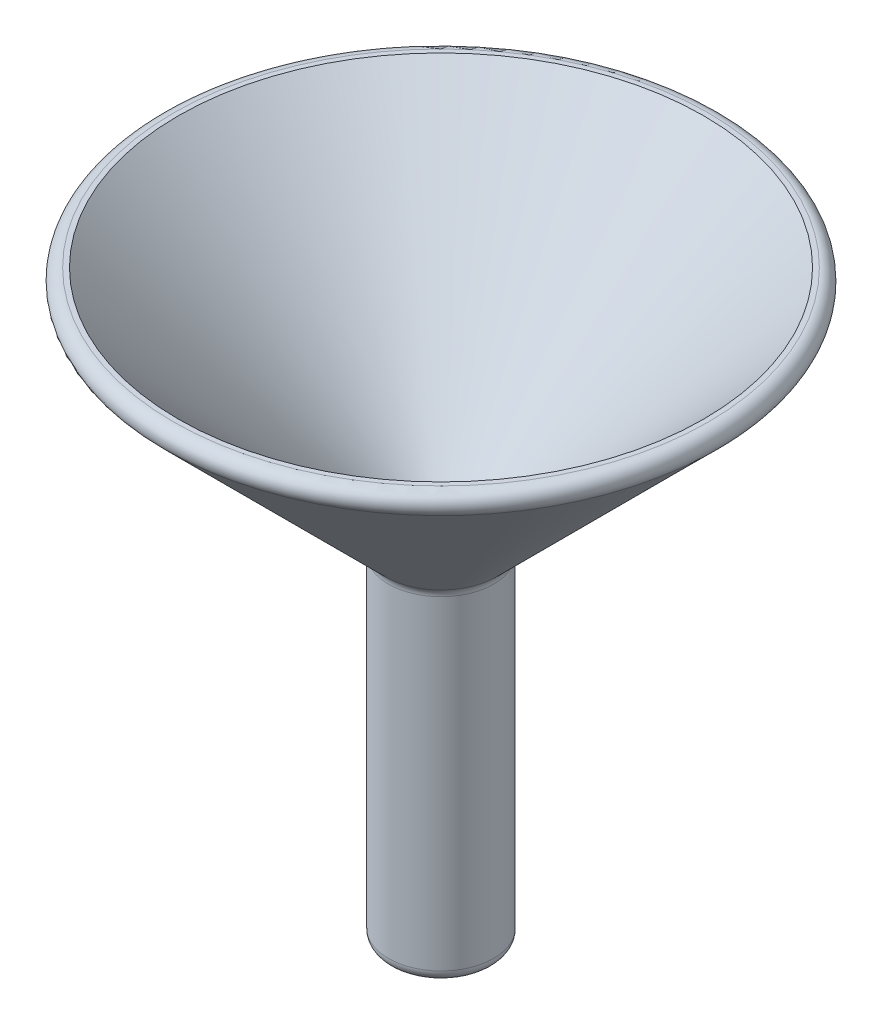
ISO-10303-21;
HEADER;
FILE_DESCRIPTION(('STEP AP214'),'2;1');
FILE_NAME('part.step','',(''),(''),'','','');
FILE_SCHEMA(('AUTOMOTIVE_DESIGN { 1 0 10303 214 1 1 1 1 }'));
ENDSEC;
DATA;
#1=APPLICATION_CONTEXT('core data for automotive mechanical design processes');
#2=APPLICATION_PROTOCOL_DEFINITION('international standard','automotive_design',2000,#1);
#3=PRODUCT_CONTEXT('',#1,'mechanical');
#4=PRODUCT('Part','Part','',(#3));
#5=PRODUCT_RELATED_PRODUCT_CATEGORY('part','',(#4));
#6=PRODUCT_DEFINITION_FORMATION('','',#4);
#7=PRODUCT_DEFINITION_CONTEXT('part definition',#1,'design');
#8=PRODUCT_DEFINITION('design','',#6,#7);
#9=PRODUCT_DEFINITION_SHAPE('','',#8);
#10=(LENGTH_UNIT() NAMED_UNIT(*) SI_UNIT(.MILLI.,.METRE.));
#11=(NAMED_UNIT(*) PLANE_ANGLE_UNIT() SI_UNIT($,.RADIAN.));
#12=(NAMED_UNIT(*) SI_UNIT($,.STERADIAN.) SOLID_ANGLE_UNIT());
#13=UNCERTAINTY_MEASURE_WITH_UNIT(LENGTH_MEASURE(1.E-05),#10,'distance_accuracy_value','');
#14=(GEOMETRIC_REPRESENTATION_CONTEXT(3) GLOBAL_UNCERTAINTY_ASSIGNED_CONTEXT((#13)) GLOBAL_UNIT_ASSIGNED_CONTEXT((#10,
#11,#12)) REPRESENTATION_CONTEXT('',''));
#15=CARTESIAN_POINT('',(0.,0.,0.));
#16=DIRECTION('',(0.,0.,1.));
#17=DIRECTION('',(1.,0.,0.));
#18=AXIS2_PLACEMENT_3D('',#15,#16,#17);
#19=CARTESIAN_POINT('',(0.,20.0000000000002,0.));
#20=DIRECTION('',(0.,1.,0.));
#21=DIRECTION('',(0.,0.,1.));
#22=AXIS2_PLACEMENT_3D('',#19,#20,#21);
#23=CONICAL_SURFACE('',#22,22.5,0.785398163397443);
#24=CARTESIAN_POINT('',(0.,0.,0.));
#25=DIRECTION('',(0.,-1.,0.));
#26=DIRECTION('',(0.,0.,-1.));
#27=AXIS2_PLACEMENT_3D('',#24,#25,#26);
#28=CIRCLE('',#27,2.5);
#29=CARTESIAN_POINT('',(0.,0.,-2.5));
#30=VERTEX_POINT('',#29);
#31=EDGE_CURVE('E63',#30,#30,#28,.T.);
#32=ORIENTED_EDGE('',*,*,#31,.T.);
#33=EDGE_LOOP('',(#32));
#34=FACE_BOUND('',#33,.T.);
#35=CARTESIAN_POINT('',(0.,20.0000000000002,0.));
#36=DIRECTION('',(0.,-1.,0.));
#37=DIRECTION('',(0.,0.,-1.));
#38=AXIS2_PLACEMENT_3D('',#35,#36,#37);
#39=CIRCLE('',#38,22.5);
#40=CARTESIAN_POINT('',(0.,20.0000000000002,-22.5));
#41=VERTEX_POINT('',#40);
#42=EDGE_CURVE('E57',#41,#41,#39,.T.);
#43=ORIENTED_EDGE('',*,*,#42,.F.);
#44=EDGE_LOOP('',(#43));
#45=FACE_BOUND('',#44,.T.);
#46=ADVANCED_FACE('F31',(#34,#45),#23,.F.);
#47=CARTESIAN_POINT('',(22.5,20.0000000000002,0.));
#48=DIRECTION('',(0.,1.,0.));
#49=DIRECTION('',(0.,0.,1.));
#50=AXIS2_PLACEMENT_3D('',#47,#48,#49);
#51=PLANE('',#50);
#52=CARTESIAN_POINT('',(0.,20.0000000000002,0.));
#53=DIRECTION('',(0.,1.,0.));
#54=DIRECTION('',(0.,0.,1.));
#55=AXIS2_PLACEMENT_3D('',#52,#53,#54);
#56=CIRCLE('',#55,22.9142135623731);
#57=CARTESIAN_POINT('',(0.,20.0000000000002,22.9142135623731));
#58=VERTEX_POINT('',#57);
#59=EDGE_CURVE('E46',#58,#58,#56,.T.);
#60=ORIENTED_EDGE('',*,*,#59,.T.);
#61=EDGE_LOOP('',(#60));
#62=FACE_BOUND('',#61,.T.);
#63=ORIENTED_EDGE('',*,*,#42,.T.);
#64=EDGE_LOOP('',(#63));
#65=FACE_BOUND('',#64,.T.);
#66=ADVANCED_FACE('F85',(#62,#65),#51,.T.);
#67=CARTESIAN_POINT('',(0.,-0.828427124746184,0.));
#68=DIRECTION('',(0.,1.,0.));
#69=DIRECTION('',(0.,0.,1.));
#70=AXIS2_PLACEMENT_3D('',#67,#68,#69);
#71=CONICAL_SURFACE('',#70,4.5,0.785398163397443);
#72=CARTESIAN_POINT('',(0.,18.2928932188137,0.));
#73=DIRECTION('',(0.,-1.,0.));
#74=DIRECTION('',(0.,0.,-1.));
#75=AXIS2_PLACEMENT_3D('',#72,#73,#74);
#76=CIRCLE('',#75,23.6213203435596);
#77=CARTESIAN_POINT('',(0.,18.2928932188137,-23.6213203435596));
#78=VERTEX_POINT('',#77);
#79=EDGE_CURVE('E51',#78,#78,#76,.T.);
#80=ORIENTED_EDGE('',*,*,#79,.T.);
#81=EDGE_LOOP('',(#80));
#82=FACE_BOUND('',#81,.T.);
#83=CARTESIAN_POINT('',(0.,-0.53553390593273,0.));
#84=DIRECTION('',(0.,1.,0.));
#85=DIRECTION('',(0.,0.,1.));
#86=AXIS2_PLACEMENT_3D('',#83,#84,#85);
#87=CIRCLE('',#86,4.79289321881345);
#88=CARTESIAN_POINT('',(0.,-0.53553390593273,4.79289321881345));
#89=VERTEX_POINT('',#88);
#90=EDGE_CURVE('E54',#89,#89,#87,.T.);
#91=ORIENTED_EDGE('',*,*,#90,.T.);
#92=EDGE_LOOP('',(#91));
#93=FACE_BOUND('',#92,.T.);
#94=ADVANCED_FACE('F90',(#82,#93),#71,.T.);
#95=CARTESIAN_POINT('',(0.,0.,0.));
#96=DIRECTION('',(0.,-1.,0.));
#97=DIRECTION('',(0.,0.,-1.));
#98=AXIS2_PLACEMENT_3D('',#95,#96,#97);
#99=CYLINDRICAL_SURFACE('',#98,4.5);
#100=CARTESIAN_POINT('',(0.,-1.24264068711927,0.));
#101=DIRECTION('',(0.,-1.,0.));
#102=DIRECTION('',(0.,0.,-1.));
#103=AXIS2_PLACEMENT_3D('',#100,#101,#102);
#104=CIRCLE('',#103,4.5);
#105=CARTESIAN_POINT('',(0.,-1.24264068711927,-4.5));
#106=VERTEX_POINT('',#105);
#107=EDGE_CURVE('E38',#106,#106,#104,.T.);
#108=ORIENTED_EDGE('',*,*,#107,.T.);
#109=EDGE_LOOP('',(#108));
#110=FACE_BOUND('',#109,.T.);
#111=CARTESIAN_POINT('',(0.,-29.,0.));
#112=DIRECTION('',(0.,-1.,0.));
#113=DIRECTION('',(0.,0.,-1.));
#114=AXIS2_PLACEMENT_3D('',#111,#112,#113);
#115=CIRCLE('',#114,4.5);
#116=CARTESIAN_POINT('',(0.,-29.,-4.5));
#117=VERTEX_POINT('',#116);
#118=EDGE_CURVE('E42',#117,#117,#115,.F.);
#119=ORIENTED_EDGE('',*,*,#118,.T.);
#120=EDGE_LOOP('',(#119));
#121=FACE_BOUND('',#120,.T.);
#122=ADVANCED_FACE('F82',(#110,#121),#99,.T.);
#123=CARTESIAN_POINT('',(2.5,-30.,0.));
#124=DIRECTION('',(0.,-1.,0.));
#125=DIRECTION('',(0.,0.,-1.));
#126=AXIS2_PLACEMENT_3D('',#123,#124,#125);
#127=PLANE('',#126);
#128=CARTESIAN_POINT('',(0.,-30.,0.));
#129=DIRECTION('',(0.,-1.,0.));
#130=DIRECTION('',(0.,0.,-1.));
#131=AXIS2_PLACEMENT_3D('',#128,#129,#130);
#132=CIRCLE('',#131,3.5);
#133=CARTESIAN_POINT('',(0.,-30.,-3.5));
#134=VERTEX_POINT('',#133);
#135=EDGE_CURVE('E10',#134,#134,#132,.T.);
#136=ORIENTED_EDGE('',*,*,#135,.T.);
#137=EDGE_LOOP('',(#136));
#138=FACE_BOUND('',#137,.T.);
#139=CARTESIAN_POINT('',(0.,-30.,0.));
#140=DIRECTION('',(0.,-1.,0.));
#141=DIRECTION('',(0.,0.,-1.));
#142=AXIS2_PLACEMENT_3D('',#139,#140,#141);
#143=CIRCLE('',#142,2.5);
#144=CARTESIAN_POINT('',(0.,-30.,-2.5));
#145=VERTEX_POINT('',#144);
#146=EDGE_CURVE('E60',#145,#145,#143,.T.);
#147=ORIENTED_EDGE('',*,*,#146,.F.);
#148=EDGE_LOOP('',(#147));
#149=FACE_BOUND('',#148,.T.);
#150=ADVANCED_FACE('F72',(#138,#149),#127,.T.);
#151=CARTESIAN_POINT('',(0.,0.,0.));
#152=DIRECTION('',(0.,-1.,0.));
#153=DIRECTION('',(0.,0.,-1.));
#154=AXIS2_PLACEMENT_3D('',#151,#152,#153);
#155=CYLINDRICAL_SURFACE('',#154,2.5);
#156=ORIENTED_EDGE('',*,*,#146,.T.);
#157=EDGE_LOOP('',(#156));
#158=FACE_BOUND('',#157,.T.);
#159=ORIENTED_EDGE('',*,*,#31,.F.);
#160=EDGE_LOOP('',(#159));
#161=FACE_BOUND('',#160,.T.);
#162=ADVANCED_FACE('F69',(#158,#161),#155,.F.);
#163=CARTESIAN_POINT('',(0.,19.0000000000002,0.));
#164=DIRECTION('',(0.,1.,0.));
#165=DIRECTION('',(0.,0.,1.));
#166=AXIS2_PLACEMENT_3D('',#163,#164,#165);
#167=TOROIDAL_SURFACE('',#166,22.9142135623731,1.);
#168=ORIENTED_EDGE('',*,*,#59,.F.);
#169=EDGE_LOOP('',(#168));
#170=FACE_BOUND('',#169,.T.);
#171=ORIENTED_EDGE('',*,*,#79,.F.);
#172=EDGE_LOOP('',(#171));
#173=FACE_BOUND('',#172,.T.);
#174=ADVANCED_FACE('F71',(#170,#173),#167,.T.);
#175=CARTESIAN_POINT('',(0.,-1.24264068711927,0.));
#176=DIRECTION('',(0.,-1.,0.));
#177=DIRECTION('',(0.,0.,-1.));
#178=AXIS2_PLACEMENT_3D('',#175,#176,#177);
#179=TOROIDAL_SURFACE('',#178,5.5,1.);
#180=ORIENTED_EDGE('',*,*,#90,.F.);
#181=EDGE_LOOP('',(#180));
#182=FACE_BOUND('',#181,.T.);
#183=ORIENTED_EDGE('',*,*,#107,.F.);
#184=EDGE_LOOP('',(#183));
#185=FACE_BOUND('',#184,.T.);
#186=ADVANCED_FACE('F79',(#182,#185),#179,.F.);
#187=CARTESIAN_POINT('',(0.,-29.,0.));
#188=DIRECTION('',(0.,-1.,0.));
#189=DIRECTION('',(0.,0.,-1.));
#190=AXIS2_PLACEMENT_3D('',#187,#188,#189);
#191=TOROIDAL_SURFACE('',#190,3.5,1.);
#192=ORIENTED_EDGE('',*,*,#118,.F.);
#193=EDGE_LOOP('',(#192));
#194=FACE_BOUND('',#193,.T.);
#195=ORIENTED_EDGE('',*,*,#135,.F.);
#196=EDGE_LOOP('',(#195));
#197=FACE_BOUND('',#196,.T.);
#198=ADVANCED_FACE('F33',(#194,#197),#191,.T.);
#199=CLOSED_SHELL('',(#46,#66,#94,#122,#150,#162,#174,#186,#198));
#200=MANIFOLD_SOLID_BREP('B2',#199);
#201=ADVANCED_BREP_SHAPE_REPRESENTATION('',(#18,#200),#14);
#202=SHAPE_DEFINITION_REPRESENTATION(#9,#201);
ENDSEC;
END-ISO-10303-21;
